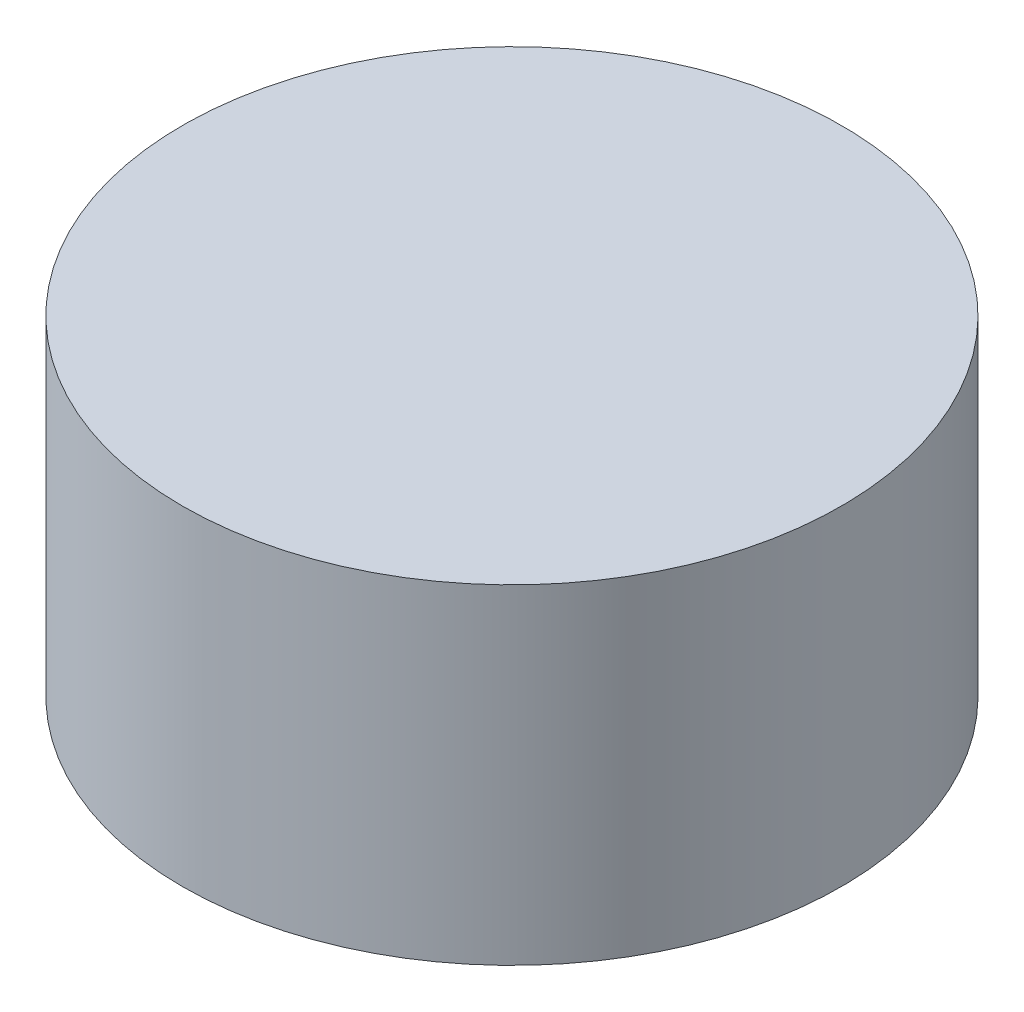
ISO-10303-21;
HEADER;
FILE_DESCRIPTION(('STEP AP214'),'2;1');
FILE_NAME('part.step','',(''),(''),'','','');
FILE_SCHEMA(('AUTOMOTIVE_DESIGN { 1 0 10303 214 1 1 1 1 }'));
ENDSEC;
DATA;
#1=APPLICATION_CONTEXT('core data for automotive mechanical design processes');
#2=APPLICATION_PROTOCOL_DEFINITION('international standard','automotive_design',2000,#1);
#3=PRODUCT_CONTEXT('',#1,'mechanical');
#4=PRODUCT('Part','Part','',(#3));
#5=PRODUCT_RELATED_PRODUCT_CATEGORY('part','',(#4));
#6=PRODUCT_DEFINITION_FORMATION('','',#4);
#7=PRODUCT_DEFINITION_CONTEXT('part definition',#1,'design');
#8=PRODUCT_DEFINITION('design','',#6,#7);
#9=PRODUCT_DEFINITION_SHAPE('','',#8);
#10=(LENGTH_UNIT() NAMED_UNIT(*) SI_UNIT(.MILLI.,.METRE.));
#11=(NAMED_UNIT(*) PLANE_ANGLE_UNIT() SI_UNIT($,.RADIAN.));
#12=(NAMED_UNIT(*) SI_UNIT($,.STERADIAN.) SOLID_ANGLE_UNIT());
#13=UNCERTAINTY_MEASURE_WITH_UNIT(LENGTH_MEASURE(1.E-05),#10,'distance_accuracy_value','');
#14=(GEOMETRIC_REPRESENTATION_CONTEXT(3) GLOBAL_UNCERTAINTY_ASSIGNED_CONTEXT((#13)) GLOBAL_UNIT_ASSIGNED_CONTEXT((#10,
#11,#12)) REPRESENTATION_CONTEXT('',''));
#15=CARTESIAN_POINT('',(0.,0.,0.));
#16=DIRECTION('',(0.,0.,1.));
#17=DIRECTION('',(1.,0.,0.));
#18=AXIS2_PLACEMENT_3D('',#15,#16,#17);
#19=CARTESIAN_POINT('',(0.,10.,0.));
#20=DIRECTION('',(0.,-1.,0.));
#21=DIRECTION('',(0.,0.,-1.));
#22=AXIS2_PLACEMENT_3D('',#19,#20,#21);
#23=CYLINDRICAL_SURFACE('',#22,10.);
#24=CARTESIAN_POINT('',(0.,10.,0.));
#25=DIRECTION('',(0.,1.,0.));
#26=DIRECTION('',(0.,0.,1.));
#27=AXIS2_PLACEMENT_3D('',#24,#25,#26);
#28=CIRCLE('',#27,10.);
#29=CARTESIAN_POINT('',(0.,10.,10.));
#30=VERTEX_POINT('',#29);
#31=EDGE_CURVE('E10',#30,#30,#28,.T.);
#32=ORIENTED_EDGE('',*,*,#31,.F.);
#33=EDGE_LOOP('',(#32));
#34=FACE_BOUND('',#33,.T.);
#35=CARTESIAN_POINT('',(0.,0.,0.));
#36=DIRECTION('',(0.,1.,0.));
#37=DIRECTION('',(0.,0.,1.));
#38=AXIS2_PLACEMENT_3D('',#35,#36,#37);
#39=CIRCLE('',#38,10.);
#40=CARTESIAN_POINT('',(0.,0.,10.));
#41=VERTEX_POINT('',#40);
#42=EDGE_CURVE('E40',#41,#41,#39,.T.);
#43=ORIENTED_EDGE('',*,*,#42,.T.);
#44=EDGE_LOOP('',(#43));
#45=FACE_BOUND('',#44,.T.);
#46=ADVANCED_FACE('F37',(#34,#45),#23,.T.);
#47=CARTESIAN_POINT('',(0.,10.,0.));
#48=DIRECTION('',(0.,1.,0.));
#49=DIRECTION('',(0.,0.,1.));
#50=AXIS2_PLACEMENT_3D('',#47,#48,#49);
#51=PLANE('',#50);
#52=ORIENTED_EDGE('',*,*,#31,.T.);
#53=EDGE_LOOP('',(#52));
#54=FACE_BOUND('',#53,.T.);
#55=ADVANCED_FACE('F54',(#54),#51,.T.);
#56=CARTESIAN_POINT('',(0.,0.,0.));
#57=DIRECTION('',(0.,1.,0.));
#58=DIRECTION('',(0.,0.,1.));
#59=AXIS2_PLACEMENT_3D('',#56,#57,#58);
#60=PLANE('',#59);
#61=ORIENTED_EDGE('',*,*,#42,.F.);
#62=EDGE_LOOP('',(#61));
#63=FACE_BOUND('',#62,.T.);
#64=ADVANCED_FACE('F52',(#63),#60,.F.);
#65=CLOSED_SHELL('',(#46,#55,#64));
#66=MANIFOLD_SOLID_BREP('B2',#65);
#67=ADVANCED_BREP_SHAPE_REPRESENTATION('',(#18,#66),#14);
#68=SHAPE_DEFINITION_REPRESENTATION(#9,#67);
ENDSEC;
END-ISO-10303-21;
